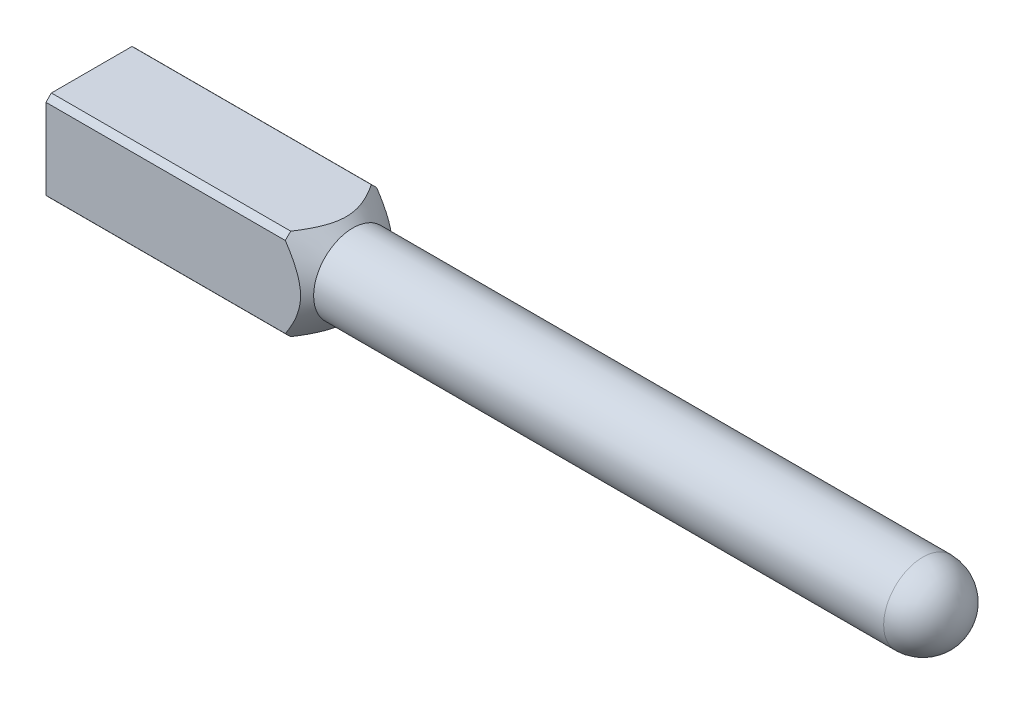
ISO-10303-21;
HEADER;
FILE_DESCRIPTION(('STEP AP214'),'2;1');
FILE_NAME('part.step','',(''),(''),'','','');
FILE_SCHEMA(('AUTOMOTIVE_DESIGN { 1 0 10303 214 1 1 1 1 }'));
ENDSEC;
DATA;
#1=APPLICATION_CONTEXT('core data for automotive mechanical design processes');
#2=APPLICATION_PROTOCOL_DEFINITION('international standard','automotive_design',2000,#1);
#3=PRODUCT_CONTEXT('',#1,'mechanical');
#4=PRODUCT('Part','Part','',(#3));
#5=PRODUCT_RELATED_PRODUCT_CATEGORY('part','',(#4));
#6=PRODUCT_DEFINITION_FORMATION('','',#4);
#7=PRODUCT_DEFINITION_CONTEXT('part definition',#1,'design');
#8=PRODUCT_DEFINITION('design','',#6,#7);
#9=PRODUCT_DEFINITION_SHAPE('','',#8);
#10=(LENGTH_UNIT() NAMED_UNIT(*) SI_UNIT(.MILLI.,.METRE.));
#11=(NAMED_UNIT(*) PLANE_ANGLE_UNIT() SI_UNIT($,.RADIAN.));
#12=(NAMED_UNIT(*) SI_UNIT($,.STERADIAN.) SOLID_ANGLE_UNIT());
#13=UNCERTAINTY_MEASURE_WITH_UNIT(LENGTH_MEASURE(1.E-05),#10,'distance_accuracy_value','');
#14=(GEOMETRIC_REPRESENTATION_CONTEXT(3) GLOBAL_UNCERTAINTY_ASSIGNED_CONTEXT((#13)) GLOBAL_UNIT_ASSIGNED_CONTEXT((#10,
#11,#12)) REPRESENTATION_CONTEXT('',''));
#15=CARTESIAN_POINT('',(0.,0.,0.));
#16=DIRECTION('',(0.,0.,1.));
#17=DIRECTION('',(1.,0.,0.));
#18=AXIS2_PLACEMENT_3D('',#15,#16,#17);
#19=CARTESIAN_POINT('',(0.,0.,0.));
#20=DIRECTION('',(-1.,0.,0.));
#21=DIRECTION('',(0.,0.,1.));
#22=AXIS2_PLACEMENT_3D('',#19,#20,#21);
#23=CYLINDRICAL_SURFACE('',#22,0.355599999999984);
#24=DIRECTION('',(-1.,0.,0.));
#25=VECTOR('',#24,1.);
#26=CARTESIAN_POINT('',(0.,0.235207291553611,0.266700000000005));
#27=LINE('',#26,#25);
#28=CARTESIAN_POINT('',(1.39700000000008,0.235207291553611,0.266700000000006));
#29=VERTEX_POINT('',#28);
#30=CARTESIAN_POINT('',(0.,0.235207291553611,0.266700000000005));
#31=VERTEX_POINT('',#30);
#32=EDGE_CURVE('E11',#29,#31,#27,.T.);
#33=ORIENTED_EDGE('',*,*,#32,.F.);
#34=CARTESIAN_POINT('',(1.39700000000008,0.,0.));
#35=DIRECTION('',(-1.,0.,0.));
#36=DIRECTION('',(0.,0.,1.));
#37=AXIS2_PLACEMENT_3D('',#34,#35,#36);
#38=CIRCLE('',#37,0.355599999999984);
#39=CARTESIAN_POINT('',(1.39700000000008,0.266699999999942,0.235207291553683));
#40=VERTEX_POINT('',#39);
#41=EDGE_CURVE('E81',#29,#40,#38,.T.);
#42=ORIENTED_EDGE('',*,*,#41,.T.);
#43=DIRECTION('',(-1.,0.,0.));
#44=VECTOR('',#43,1.);
#45=CARTESIAN_POINT('',(0.,0.266699999999942,0.235207291553683));
#46=LINE('',#45,#44);
#47=CARTESIAN_POINT('',(0.,0.266699999999942,0.235207291553683));
#48=VERTEX_POINT('',#47);
#49=EDGE_CURVE('E85',#48,#40,#46,.F.);
#50=ORIENTED_EDGE('',*,*,#49,.F.);
#51=CARTESIAN_POINT('',(0.,0.,0.));
#52=DIRECTION('',(-1.,0.,0.));
#53=DIRECTION('',(0.,0.,1.));
#54=AXIS2_PLACEMENT_3D('',#51,#52,#53);
#55=CIRCLE('',#54,0.355599999999984);
#56=EDGE_CURVE('E139',#31,#48,#55,.T.);
#57=ORIENTED_EDGE('',*,*,#56,.F.);
#58=EDGE_LOOP('',(#33,#42,#50,#57));
#59=FACE_BOUND('',#58,.T.);
#60=ADVANCED_FACE('F16',(#59),#23,.T.);
#61=DIRECTION('',(-1.,0.,0.));
#62=VECTOR('',#61,1.);
#63=CARTESIAN_POINT('',(0.,-0.235207291553611,0.266700000000005));
#64=LINE('',#63,#62);
#65=CARTESIAN_POINT('',(0.,-0.235207291553611,0.266700000000005));
#66=VERTEX_POINT('',#65);
#67=CARTESIAN_POINT('',(1.39700000000008,-0.235207291553611,0.266700000000005));
#68=VERTEX_POINT('',#67);
#69=EDGE_CURVE('E24',#66,#68,#64,.F.);
#70=ORIENTED_EDGE('',*,*,#69,.F.);
#71=CARTESIAN_POINT('',(0.,-0.266700000000078,0.235207291553529));
#72=VERTEX_POINT('',#71);
#73=EDGE_CURVE('E133',#72,#66,#55,.T.);
#74=ORIENTED_EDGE('',*,*,#73,.F.);
#75=DIRECTION('',(-1.,0.,0.));
#76=VECTOR('',#75,1.);
#77=CARTESIAN_POINT('',(0.,-0.266700000000078,0.235207291553529));
#78=LINE('',#77,#76);
#79=CARTESIAN_POINT('',(1.39700000000008,-0.266700000000078,0.235207291553529));
#80=VERTEX_POINT('',#79);
#81=EDGE_CURVE('E34',#80,#72,#78,.T.);
#82=ORIENTED_EDGE('',*,*,#81,.F.);
#83=EDGE_CURVE('E93',#80,#68,#38,.T.);
#84=ORIENTED_EDGE('',*,*,#83,.T.);
#85=EDGE_LOOP('',(#70,#74,#82,#84));
#86=FACE_BOUND('',#85,.T.);
#87=ADVANCED_FACE('F132',(#86),#23,.T.);
#88=DIRECTION('',(-1.,0.,0.));
#89=VECTOR('',#88,1.);
#90=CARTESIAN_POINT('',(0.,-0.266700000000078,-0.235207291553529));
#91=LINE('',#90,#89);
#92=CARTESIAN_POINT('',(0.,-0.266700000000078,-0.235207291553529));
#93=VERTEX_POINT('',#92);
#94=CARTESIAN_POINT('',(1.39700000000008,-0.266700000000078,-0.235207291553529));
#95=VERTEX_POINT('',#94);
#96=EDGE_CURVE('E122',#93,#95,#91,.F.);
#97=ORIENTED_EDGE('',*,*,#96,.F.);
#98=CARTESIAN_POINT('',(0.,-0.235207291553624,-0.266699999999994));
#99=VERTEX_POINT('',#98);
#100=EDGE_CURVE('E137',#99,#93,#55,.T.);
#101=ORIENTED_EDGE('',*,*,#100,.F.);
#102=DIRECTION('',(-1.,0.,0.));
#103=VECTOR('',#102,1.);
#104=CARTESIAN_POINT('',(0.,-0.235207291553624,-0.266699999999994));
#105=LINE('',#104,#103);
#106=CARTESIAN_POINT('',(1.39700000000008,-0.235207291553624,-0.266699999999994));
#107=VERTEX_POINT('',#106);
#108=EDGE_CURVE('E119',#107,#99,#105,.T.);
#109=ORIENTED_EDGE('',*,*,#108,.F.);
#110=EDGE_CURVE('E143',#107,#95,#38,.T.);
#111=ORIENTED_EDGE('',*,*,#110,.T.);
#112=EDGE_LOOP('',(#97,#101,#109,#111));
#113=FACE_BOUND('',#112,.T.);
#114=ADVANCED_FACE('F207',(#113),#23,.T.);
#115=CARTESIAN_POINT('',(0.,0.355599999999984,0.));
#116=DIRECTION('',(1.,0.,0.));
#117=DIRECTION('',(0.,0.,-1.));
#118=AXIS2_PLACEMENT_3D('',#115,#116,#117);
#119=PLANE('',#118);
#120=DIRECTION('',(0.,1.,0.));
#121=VECTOR('',#120,1.);
#122=CARTESIAN_POINT('',(0.,0.266699999999942,0.266700000000005));
#123=LINE('',#122,#121);
#124=EDGE_CURVE('E130',#66,#31,#123,.T.);
#125=ORIENTED_EDGE('',*,*,#124,.T.);
#126=ORIENTED_EDGE('',*,*,#56,.T.);
#127=DIRECTION('',(0.,0.,-1.));
#128=VECTOR('',#127,1.);
#129=CARTESIAN_POINT('',(0.,0.266699999999942,0.266700000000005));
#130=LINE('',#129,#128);
#131=CARTESIAN_POINT('',(0.,0.266699999999943,-0.235207291553683));
#132=VERTEX_POINT('',#131);
#133=EDGE_CURVE('E107',#48,#132,#130,.T.);
#134=ORIENTED_EDGE('',*,*,#133,.T.);
#135=CARTESIAN_POINT('',(0.,0.235207291553624,-0.266699999999994));
#136=VERTEX_POINT('',#135);
#137=EDGE_CURVE('E140',#132,#136,#55,.T.);
#138=ORIENTED_EDGE('',*,*,#137,.T.);
#139=DIRECTION('',(0.,-1.,0.));
#140=VECTOR('',#139,1.);
#141=CARTESIAN_POINT('',(0.,-0.266700000000078,-0.266699999999994));
#142=LINE('',#141,#140);
#143=EDGE_CURVE('E147',#136,#99,#142,.T.);
#144=ORIENTED_EDGE('',*,*,#143,.T.);
#145=ORIENTED_EDGE('',*,*,#100,.T.);
#146=DIRECTION('',(0.,0.,1.));
#147=VECTOR('',#146,1.);
#148=CARTESIAN_POINT('',(0.,-0.266700000000078,-0.266699999999994));
#149=LINE('',#148,#147);
#150=EDGE_CURVE('E103',#93,#72,#149,.T.);
#151=ORIENTED_EDGE('',*,*,#150,.T.);
#152=ORIENTED_EDGE('',*,*,#73,.T.);
#153=EDGE_LOOP('',(#125,#126,#134,#138,#144,#145,#151,#152));
#154=FACE_BOUND('',#153,.T.);
#155=ADVANCED_FACE('F18',(#154),#119,.F.);
#156=CARTESIAN_POINT('',(4.85140000000006,0.,0.));
#157=DIRECTION('',(-1.,0.,0.));
#158=DIRECTION('',(0.,-1.,0.));
#159=AXIS2_PLACEMENT_3D('',#156,#157,#158);
#160=SPHERICAL_SURFACE('',#159,0.228599999999968);
#161=CARTESIAN_POINT('',(5.08000000000003,0.,0.));
#162=VERTEX_POINT('',#161);
#163=VERTEX_LOOP('',#162);
#164=FACE_BOUND('',#163,.T.);
#165=CARTESIAN_POINT('',(4.85140000000006,0.,0.));
#166=DIRECTION('',(-1.,0.,0.));
#167=DIRECTION('',(0.,0.,1.));
#168=AXIS2_PLACEMENT_3D('',#165,#166,#167);
#169=CIRCLE('',#168,0.228600000000023);
#170=CARTESIAN_POINT('',(4.85140000000006,0.,0.228600000000023));
#171=VERTEX_POINT('',#170);
#172=EDGE_CURVE('E109',#171,#171,#169,.T.);
#173=ORIENTED_EDGE('',*,*,#172,.F.);
#174=EDGE_LOOP('',(#173));
#175=FACE_BOUND('',#174,.T.);
#176=ADVANCED_FACE('F218',(#164,#175),#160,.T.);
#177=CARTESIAN_POINT('',(0.,0.,0.));
#178=DIRECTION('',(-1.,0.,0.));
#179=DIRECTION('',(0.,0.,1.));
#180=AXIS2_PLACEMENT_3D('',#177,#178,#179);
#181=CYLINDRICAL_SURFACE('',#180,0.228600000000023);
#182=CARTESIAN_POINT('',(1.52400000000001,0.,0.));
#183=DIRECTION('',(-1.,0.,0.));
#184=DIRECTION('',(0.,0.,1.));
#185=AXIS2_PLACEMENT_3D('',#182,#183,#184);
#186=CIRCLE('',#185,0.228600000000023);
#187=CARTESIAN_POINT('',(1.52400000000001,0.,0.228600000000023));
#188=VERTEX_POINT('',#187);
#189=EDGE_CURVE('E90',#188,#188,#186,.T.);
#190=ORIENTED_EDGE('',*,*,#189,.F.);
#191=EDGE_LOOP('',(#190));
#192=FACE_BOUND('',#191,.T.);
#193=ORIENTED_EDGE('',*,*,#172,.T.);
#194=EDGE_LOOP('',(#193));
#195=FACE_BOUND('',#194,.T.);
#196=ADVANCED_FACE('F177',(#192,#195),#181,.T.);
#197=CARTESIAN_POINT('',(1.52400000000001,0.,0.));
#198=DIRECTION('',(-1.,0.,0.));
#199=DIRECTION('',(0.,0.,1.));
#200=AXIS2_PLACEMENT_3D('',#197,#198,#199);
#201=CONICAL_SURFACE('',#200,0.228600000000023,0.785398163397551);
#202=CARTESIAN_POINT('',(1.19876831041151,-0.485387113953952,0.266700000000005));
#203=CARTESIAN_POINT('',(1.21889522419031,-0.462375903807712,0.266700000000005));
#204=CARTESIAN_POINT('',(1.23888388873439,-0.439229851768335,0.266700000000005));
#205=CARTESIAN_POINT('',(1.27839903483986,-0.39231373172233,0.266700000000005));
#206=CARTESIAN_POINT('',(1.29792207932206,-0.368540780514053,0.266700000000005));
#207=CARTESIAN_POINT('',(1.33751798782103,-0.318458413503585,0.266700000000005));
#208=CARTESIAN_POINT('',(1.35752070412582,-0.292093170509722,0.266700000000005));
#209=CARTESIAN_POINT('',(1.3956207454587,-0.238073274913434,0.266700000000005));
#210=CARTESIAN_POINT('',(1.41372341285895,-0.210422571210806,0.266700000000005));
#211=CARTESIAN_POINT('',(1.4408271375088,-0.162259028006068,0.266700000000005));
#212=CARTESIAN_POINT('',(1.45087312770009,-0.142351031541528,0.266700000000005));
#213=CARTESIAN_POINT('',(1.46785159789939,-0.101447693538989,0.266700000000005));
#214=CARTESIAN_POINT('',(1.4748216052147,-0.0804691531700485,0.266700000000005));
#215=CARTESIAN_POINT('',(1.48282874384449,-0.0433426835818835,0.266700000000005));
#216=CARTESIAN_POINT('',(1.4849674536007,-0.0274437937727022,0.266700000000005));
#217=CARTESIAN_POINT('',(1.48633754707791,0.00445871803318953,0.266700000000005));
#218=CARTESIAN_POINT('',(1.48557386947214,0.0204621159059783,0.266700000000005));
#219=CARTESIAN_POINT('',(1.4808487652359,0.0555486296308875,0.266700000000005));
#220=CARTESIAN_POINT('',(1.47622415398639,0.0745393445501283,0.266700000000005));
#221=CARTESIAN_POINT('',(1.46706322789021,0.102382269838386,0.266700000000005));
#222=CARTESIAN_POINT('',(1.46360345996161,0.111624627451476,0.266700000000005));
#223=CARTESIAN_POINT('',(1.45607946433962,0.129859713157512,0.266700000000005));
#224=CARTESIAN_POINT('',(1.45201538536061,0.138852502022345,0.266700000000005));
#225=CARTESIAN_POINT('',(1.43356294604938,0.17697124441658,0.266700000000005));
#226=CARTESIAN_POINT('',(1.41687513404387,0.204965063179582,0.266700000000005));
#227=CARTESIAN_POINT('',(1.38108713463985,0.25943732009984,0.266700000000005));
#228=CARTESIAN_POINT('',(1.36197571147376,0.285907807076295,0.266700000000005));
#229=CARTESIAN_POINT('',(1.32414338116473,0.335686865178382,0.266700000000005));
#230=CARTESIAN_POINT('',(1.30552537847485,0.359073869048991,0.266700000000005));
#231=CARTESIAN_POINT('',(1.26778121527321,0.405066184507075,0.266700000000005));
#232=CARTESIAN_POINT('',(1.24866156488433,0.427676812413223,0.266700000000005));
#233=CARTESIAN_POINT('',(1.22938898173993,0.45013429066095,0.266700000000005));
#234=B_SPLINE_CURVE_WITH_KNOTS('',3,(#202,#203,#204,#205,#206,#207,#208,#209,#210,#211,#212,
#213,#214,#215,#216,#217,#218,#219,#220,#221,#222,#223,#224,#225,#226,#227,#228,#229,#230,#231,
#232,#233),.UNSPECIFIED.,.F.,.F.,(4,2,2,2,2,2,2,2,2,2,2,2,2,2,2,4),(0.,0.0917304332293092,
0.184003966434708,0.283258479458302,0.382225988549693,0.448992160653899,0.5149196000435,
0.562806269543839,0.610611492078913,0.668877782883773,0.698470049613775,0.728055046023747,
0.825499114464268,0.923412682240023,1.01307179683553,1.10187890551937),.UNSPECIFIED.);
#235=EDGE_CURVE('E129',#68,#29,#234,.T.);
#236=ORIENTED_EDGE('',*,*,#235,.F.);
#237=ORIENTED_EDGE('',*,*,#83,.F.);
#238=CARTESIAN_POINT('',(1.19876831041151,-0.266700000000078,-0.485387113953911));
#239=CARTESIAN_POINT('',(1.21889522419031,-0.266700000000078,-0.46237590380767));
#240=CARTESIAN_POINT('',(1.23888388873439,-0.266700000000078,-0.439229851768291));
#241=CARTESIAN_POINT('',(1.27839903483986,-0.266700000000078,-0.392313731722283));
#242=CARTESIAN_POINT('',(1.29792207932205,-0.266700000000078,-0.368540780514005));
#243=CARTESIAN_POINT('',(1.33751798782103,-0.266700000000078,-0.31845841350353));
#244=CARTESIAN_POINT('',(1.35752070412582,-0.266700000000078,-0.292093170509662));
#245=CARTESIAN_POINT('',(1.39562074545869,-0.266700000000078,-0.238073274913365));
#246=CARTESIAN_POINT('',(1.41372341285895,-0.266700000000078,-0.210422571210731));
#247=CARTESIAN_POINT('',(1.44082713750878,-0.266700000000078,-0.162259028005986));
#248=CARTESIAN_POINT('',(1.45087312770007,-0.266700000000078,-0.142351031541446));
#249=CARTESIAN_POINT('',(1.46785159789935,-0.266700000000078,-0.101447693538905));
#250=CARTESIAN_POINT('',(1.47482160521465,-0.266700000000078,-0.0804691531699643));
#251=CARTESIAN_POINT('',(1.48282874384444,-0.266700000000078,-0.0433426835817946));
#252=CARTESIAN_POINT('',(1.48496745360064,-0.266700000000078,-0.0274437937726083));
#253=CARTESIAN_POINT('',(1.48633754707783,-0.266700000000078,0.0044587180332926));
#254=CARTESIAN_POINT('',(1.48557386947206,-0.266700000000078,0.0204621159060855));
#255=CARTESIAN_POINT('',(1.4808487652358,-0.266700000000078,0.0555486296310126));
#256=CARTESIAN_POINT('',(1.47622415398628,-0.266700000000078,0.0745393445502667));
#257=CARTESIAN_POINT('',(1.46706322789009,-0.266700000000078,0.102382269838543));
#258=CARTESIAN_POINT('',(1.46360345996148,-0.266700000000078,0.111624627451639));
#259=CARTESIAN_POINT('',(1.45607946433947,-0.266700000000078,0.129859713157688));
#260=CARTESIAN_POINT('',(1.45201538536046,-0.266700000000078,0.138852502022526));
#261=CARTESIAN_POINT('',(1.43356294604919,-0.266700000000078,0.176971244416814));
#262=CARTESIAN_POINT('',(1.41687513404365,-0.266700000000078,0.20496506317986));
#263=CARTESIAN_POINT('',(1.38108713463955,-0.266700000000078,0.259437320100204));
#264=CARTESIAN_POINT('',(1.36197571147341,-0.266700000000078,0.2859078070767));
#265=CARTESIAN_POINT('',(1.32414338116431,-0.266700000000078,0.335686865178864));
#266=CARTESIAN_POINT('',(1.3055253784744,-0.266700000000078,0.359073869049507));
#267=CARTESIAN_POINT('',(1.26778121527268,-0.266700000000078,0.40506618450766));
#268=CARTESIAN_POINT('',(1.24866156488377,-0.266700000000078,0.427676812413843));
#269=CARTESIAN_POINT('',(1.22938898173933,-0.266700000000078,0.450134290661604));
#270=B_SPLINE_CURVE_WITH_KNOTS('',3,(#238,#239,#240,#241,#242,#243,#244,#245,#246,#247,#248,
#249,#250,#251,#252,#253,#254,#255,#256,#257,#258,#259,#260,#261,#262,#263,#264,#265,#266,#267,
#268,#269),.UNSPECIFIED.,.F.,.F.,(4,2,2,2,2,2,2,2,2,2,2,2,2,2,2,4),(0.,0.0917304332293109,
0.184003966434712,0.283258479458316,0.382225988549716,0.448992160653917,0.514919600043511,
0.562806269543863,0.610611492078951,0.668877782883857,0.698470049613883,0.728055046023878,
0.82549911446457,0.923412682240498,1.01307179683616,1.10187890552014),.UNSPECIFIED.);
#271=EDGE_CURVE('E141',#95,#80,#270,.T.);
#272=ORIENTED_EDGE('',*,*,#271,.F.);
#273=ORIENTED_EDGE('',*,*,#110,.F.);
#274=CARTESIAN_POINT('',(1.19876831041152,-0.485387113953947,-0.266699999999995));
#275=CARTESIAN_POINT('',(1.21889522419032,-0.462375903807708,-0.266699999999995));
#276=CARTESIAN_POINT('',(1.2388838887344,-0.439229851768331,-0.266699999999995));
#277=CARTESIAN_POINT('',(1.27839903483987,-0.392313731722327,-0.266699999999995));
#278=CARTESIAN_POINT('',(1.29792207932207,-0.368540780514051,-0.266699999999995));
#279=CARTESIAN_POINT('',(1.33751798782104,-0.318458413503585,-0.266699999999995));
#280=CARTESIAN_POINT('',(1.35752070412583,-0.292093170509722,-0.266699999999994));
#281=CARTESIAN_POINT('',(1.39562074545871,-0.238073274913436,-0.266699999999994));
#282=CARTESIAN_POINT('',(1.41372341285896,-0.210422571210809,-0.266699999999994));
#283=CARTESIAN_POINT('',(1.44082713750881,-0.162259028006072,-0.266699999999994));
#284=CARTESIAN_POINT('',(1.4508731277001,-0.142351031541533,-0.266699999999994));
#285=CARTESIAN_POINT('',(1.4678515978994,-0.101447693538994,-0.266699999999994));
#286=CARTESIAN_POINT('',(1.47482160521471,-0.0804691531700543,-0.266699999999994));
#287=CARTESIAN_POINT('',(1.4828287438445,-0.0433426835818903,-0.266699999999994));
#288=CARTESIAN_POINT('',(1.48496745360071,-0.0274437937727097,-0.266699999999994));
#289=CARTESIAN_POINT('',(1.48633754707792,0.0044587180331807,-0.266699999999994));
#290=CARTESIAN_POINT('',(1.48557386947216,0.0204621159059689,-0.266699999999994));
#291=CARTESIAN_POINT('',(1.48084876523591,0.0555486296308759,-0.266699999999994));
#292=CARTESIAN_POINT('',(1.4762241539864,0.0745393445501153,-0.266699999999994));
#293=CARTESIAN_POINT('',(1.46706322789023,0.102382269838371,-0.266699999999994));
#294=CARTESIAN_POINT('',(1.46360345996163,0.11162462745146,-0.266699999999994));
#295=CARTESIAN_POINT('',(1.45607946433963,0.129859713157495,-0.266699999999994));
#296=CARTESIAN_POINT('',(1.45201538536063,0.138852502022327,-0.266699999999994));
#297=CARTESIAN_POINT('',(1.4335629460494,0.176971244416556,-0.266699999999994));
#298=CARTESIAN_POINT('',(1.4168751340439,0.204965063179554,-0.266699999999994));
#299=CARTESIAN_POINT('',(1.38108713463988,0.259437320099804,-0.266699999999994));
#300=CARTESIAN_POINT('',(1.36197571147379,0.285907807076255,-0.266699999999994));
#301=CARTESIAN_POINT('',(1.32414338116478,0.335686865178335,-0.266699999999994));
#302=CARTESIAN_POINT('',(1.3055253784749,0.35907386904894,-0.266699999999994));
#303=CARTESIAN_POINT('',(1.26778121527327,0.405066184507017,-0.266699999999994));
#304=CARTESIAN_POINT('',(1.24866156488439,0.427676812413162,-0.266699999999994));
#305=CARTESIAN_POINT('',(1.22938898173999,0.450134290660886,-0.266699999999994));
#306=B_SPLINE_CURVE_WITH_KNOTS('',3,(#274,#275,#276,#277,#278,#279,#280,#281,#282,#283,#284,
#285,#286,#287,#288,#289,#290,#291,#292,#293,#294,#295,#296,#297,#298,#299,#300,#301,#302,#303,
#304,#305),.UNSPECIFIED.,.F.,.F.,(4,2,2,2,2,2,2,2,2,2,2,2,2,2,2,4),(0.,0.0917304332293074,
0.184003966434704,0.283258479458296,0.382225988549684,0.44899216065389,0.51491960004349,
0.562806269543827,0.610611492078899,0.668877782883754,0.698470049613754,0.728055046023723,
0.825499114464228,0.923412682239966,1.01307179683546,1.10187890551928),.UNSPECIFIED.);
#307=CARTESIAN_POINT('',(1.39700000000008,0.235207291553624,-0.266699999999994));
#308=VERTEX_POINT('',#307);
#309=EDGE_CURVE('E102',#308,#107,#306,.F.);
#310=ORIENTED_EDGE('',*,*,#309,.F.);
#311=CARTESIAN_POINT('',(1.39700000000008,0.266699999999943,-0.235207291553683));
#312=VERTEX_POINT('',#311);
#313=EDGE_CURVE('E91',#312,#308,#38,.T.);
#314=ORIENTED_EDGE('',*,*,#313,.F.);
#315=CARTESIAN_POINT('',(1.19876831041164,0.266699999999943,-0.485387113953847));
#316=CARTESIAN_POINT('',(1.21889522419043,0.266699999999943,-0.462375903807612));
#317=CARTESIAN_POINT('',(1.2388838887345,0.266699999999943,-0.439229851768241));
#318=CARTESIAN_POINT('',(1.27839903483997,0.266699999999943,-0.392313731722246));
#319=CARTESIAN_POINT('',(1.29792207932216,0.266699999999943,-0.368540780513975));
#320=CARTESIAN_POINT('',(1.33751798782112,0.266699999999943,-0.318458413503518));
#321=CARTESIAN_POINT('',(1.35752070412591,0.266699999999943,-0.29209317050966));
#322=CARTESIAN_POINT('',(1.39562074545878,0.266699999999943,-0.238073274913385));
#323=CARTESIAN_POINT('',(1.41372341285903,0.266699999999943,-0.210422571210764));
#324=CARTESIAN_POINT('',(1.44082713750887,0.266699999999943,-0.162259028006037));
#325=CARTESIAN_POINT('',(1.45087312770016,0.266699999999943,-0.142351031541502));
#326=CARTESIAN_POINT('',(1.46785159789946,0.266699999999943,-0.101447693538972));
#327=CARTESIAN_POINT('',(1.47482160521476,0.266699999999942,-0.0804691531700358));
#328=CARTESIAN_POINT('',(1.48282874384456,0.266699999999942,-0.0433426835818792));
#329=CARTESIAN_POINT('',(1.48496745360076,0.266699999999942,-0.0274437937727018));
#330=CARTESIAN_POINT('',(1.48633754707797,0.266699999999942,0.00445871803318236));
#331=CARTESIAN_POINT('',(1.48557386947221,0.266699999999942,0.0204621159059674));
#332=CARTESIAN_POINT('',(1.48084876523597,0.266699999999942,0.0555486296308678));
#333=CARTESIAN_POINT('',(1.47622415398645,0.266699999999942,0.0745393445501036));
#334=CARTESIAN_POINT('',(1.46706322789028,0.266699999999942,0.102382269838354));
#335=CARTESIAN_POINT('',(1.46360345996168,0.266699999999942,0.111624627451442));
#336=CARTESIAN_POINT('',(1.45607946433969,0.266699999999942,0.129859713157473));
#337=CARTESIAN_POINT('',(1.45201538536068,0.266699999999942,0.138852502022303));
#338=CARTESIAN_POINT('',(1.43356294604946,0.266699999999942,0.176971244416527));
#339=CARTESIAN_POINT('',(1.41687513404396,0.266699999999942,0.20496506317952));
#340=CARTESIAN_POINT('',(1.38108713463995,0.266699999999942,0.259437320099761));
#341=CARTESIAN_POINT('',(1.36197571147386,0.266699999999942,0.285907807076208));
#342=CARTESIAN_POINT('',(1.32414338116485,0.266699999999942,0.335686865178279));
#343=CARTESIAN_POINT('',(1.30552537847498,0.266699999999942,0.359073869048881));
#344=CARTESIAN_POINT('',(1.26778121527335,0.266699999999942,0.40506618450695));
#345=CARTESIAN_POINT('',(1.24866156488448,0.266699999999942,0.427676812413092));
#346=CARTESIAN_POINT('',(1.22938898174008,0.266699999999942,0.450134290660812));
#347=B_SPLINE_CURVE_WITH_KNOTS('',3,(#315,#316,#317,#318,#319,#320,#321,#322,#323,#324,#325,
#326,#327,#328,#329,#330,#331,#332,#333,#334,#335,#336,#337,#338,#339,#340,#341,#342,#343,#344,
#345,#346),.UNSPECIFIED.,.F.,.F.,(4,2,2,2,2,2,2,2,2,2,2,2,2,2,2,4),(0.,0.0917304332292888,
0.184003966434667,0.283258479458239,0.382225988549607,0.448992160653799,0.514919600043385,
0.562806269543713,0.610611492078776,0.66887778288362,0.698470049613614,0.728055046023578,
0.825499114464068,0.92341268223979,1.01307179683527,1.10187890551908),.UNSPECIFIED.);
#348=EDGE_CURVE('E96',#40,#312,#347,.F.);
#349=ORIENTED_EDGE('',*,*,#348,.F.);
#350=ORIENTED_EDGE('',*,*,#41,.F.);
#351=EDGE_LOOP('',(#236,#237,#272,#273,#310,#314,#349,#350));
#352=FACE_BOUND('',#351,.T.);
#353=ORIENTED_EDGE('',*,*,#189,.T.);
#354=EDGE_LOOP('',(#353));
#355=FACE_BOUND('',#354,.T.);
#356=ADVANCED_FACE('F97',(#352,#355),#201,.T.);
#357=DIRECTION('',(-1.,0.,0.));
#358=VECTOR('',#357,1.);
#359=CARTESIAN_POINT('',(0.,0.235207291553624,-0.266699999999994));
#360=LINE('',#359,#358);
#361=EDGE_CURVE('E111',#136,#308,#360,.F.);
#362=ORIENTED_EDGE('',*,*,#361,.F.);
#363=ORIENTED_EDGE('',*,*,#137,.F.);
#364=DIRECTION('',(-1.,0.,0.));
#365=VECTOR('',#364,1.);
#366=CARTESIAN_POINT('',(0.,0.266699999999943,-0.235207291553683));
#367=LINE('',#366,#365);
#368=EDGE_CURVE('E108',#312,#132,#367,.T.);
#369=ORIENTED_EDGE('',*,*,#368,.F.);
#370=ORIENTED_EDGE('',*,*,#313,.T.);
#371=EDGE_LOOP('',(#362,#363,#369,#370));
#372=FACE_BOUND('',#371,.T.);
#373=ADVANCED_FACE('F176',(#372),#23,.T.);
#374=CARTESIAN_POINT('',(5.08000000000003,0.266699999999942,0.266700000000005));
#375=DIRECTION('',(0.,1.,0.));
#376=DIRECTION('',(0.,0.,1.));
#377=AXIS2_PLACEMENT_3D('',#374,#375,#376);
#378=PLANE('',#377);
#379=ORIENTED_EDGE('',*,*,#348,.T.);
#380=ORIENTED_EDGE('',*,*,#368,.T.);
#381=ORIENTED_EDGE('',*,*,#133,.F.);
#382=ORIENTED_EDGE('',*,*,#49,.T.);
#383=EDGE_LOOP('',(#379,#380,#381,#382));
#384=FACE_BOUND('',#383,.T.);
#385=ADVANCED_FACE('F106',(#384),#378,.T.);
#386=CARTESIAN_POINT('',(5.08000000000003,-0.266700000000078,-0.266699999999994));
#387=DIRECTION('',(0.,0.,-1.));
#388=DIRECTION('',(0.,1.,0.));
#389=AXIS2_PLACEMENT_3D('',#386,#387,#388);
#390=PLANE('',#389);
#391=ORIENTED_EDGE('',*,*,#309,.T.);
#392=ORIENTED_EDGE('',*,*,#108,.T.);
#393=ORIENTED_EDGE('',*,*,#143,.F.);
#394=ORIENTED_EDGE('',*,*,#361,.T.);
#395=EDGE_LOOP('',(#391,#392,#393,#394));
#396=FACE_BOUND('',#395,.T.);
#397=ADVANCED_FACE('F152',(#396),#390,.T.);
#398=CARTESIAN_POINT('',(5.08000000000003,-0.266700000000078,-0.266699999999994));
#399=DIRECTION('',(0.,-1.,0.));
#400=DIRECTION('',(0.,0.,-1.));
#401=AXIS2_PLACEMENT_3D('',#398,#399,#400);
#402=PLANE('',#401);
#403=ORIENTED_EDGE('',*,*,#271,.T.);
#404=ORIENTED_EDGE('',*,*,#81,.T.);
#405=ORIENTED_EDGE('',*,*,#150,.F.);
#406=ORIENTED_EDGE('',*,*,#96,.T.);
#407=EDGE_LOOP('',(#403,#404,#405,#406));
#408=FACE_BOUND('',#407,.T.);
#409=ADVANCED_FACE('F191',(#408),#402,.T.);
#410=CARTESIAN_POINT('',(5.08000000000003,0.266699999999942,0.266700000000005));
#411=DIRECTION('',(0.,0.,1.));
#412=DIRECTION('',(0.,-1.,0.));
#413=AXIS2_PLACEMENT_3D('',#410,#411,#412);
#414=PLANE('',#413);
#415=ORIENTED_EDGE('',*,*,#235,.T.);
#416=ORIENTED_EDGE('',*,*,#32,.T.);
#417=ORIENTED_EDGE('',*,*,#124,.F.);
#418=ORIENTED_EDGE('',*,*,#69,.T.);
#419=EDGE_LOOP('',(#415,#416,#417,#418));
#420=FACE_BOUND('',#419,.T.);
#421=ADVANCED_FACE('F128',(#420),#414,.T.);
#422=CLOSED_SHELL('',(#60,#87,#114,#155,#176,#196,#356,#373,#385,#397,#409,#421));
#423=MANIFOLD_SOLID_BREP('B1',#422);
#424=ADVANCED_BREP_SHAPE_REPRESENTATION('',(#18,#423),#14);
#425=SHAPE_DEFINITION_REPRESENTATION(#9,#424);
ENDSEC;
END-ISO-10303-21;
